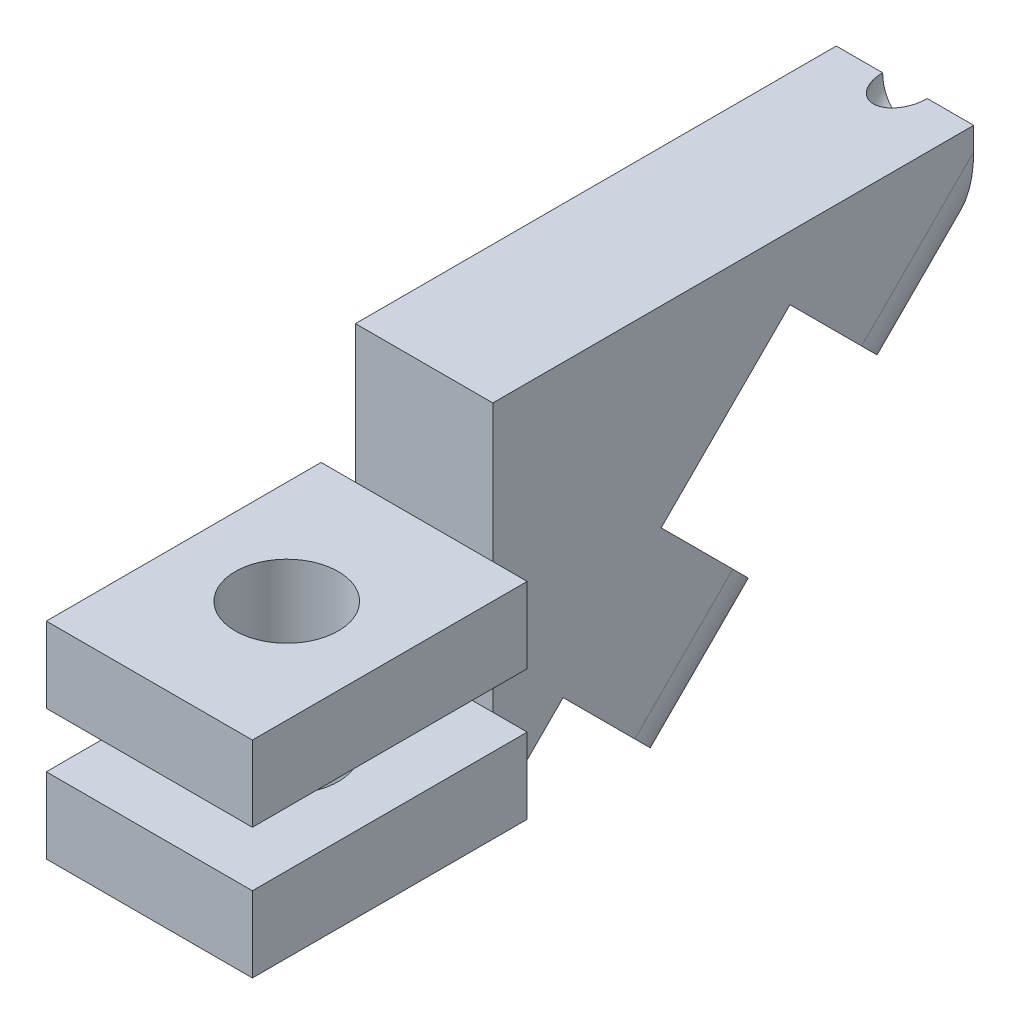
ISO-10303-21;
HEADER;
FILE_DESCRIPTION(('STEP AP214'),'2;1');
FILE_NAME('part.step','',(''),(''),'','','');
FILE_SCHEMA(('AUTOMOTIVE_DESIGN { 1 0 10303 214 1 1 1 1 }'));
ENDSEC;
DATA;
#1=APPLICATION_CONTEXT('core data for automotive mechanical design processes');
#2=APPLICATION_PROTOCOL_DEFINITION('international standard','automotive_design',2000,#1);
#3=PRODUCT_CONTEXT('',#1,'mechanical');
#4=PRODUCT('Part','Part','',(#3));
#5=PRODUCT_RELATED_PRODUCT_CATEGORY('part','',(#4));
#6=PRODUCT_DEFINITION_FORMATION('','',#4);
#7=PRODUCT_DEFINITION_CONTEXT('part definition',#1,'design');
#8=PRODUCT_DEFINITION('design','',#6,#7);
#9=PRODUCT_DEFINITION_SHAPE('','',#8);
#10=(LENGTH_UNIT() NAMED_UNIT(*) SI_UNIT(.MILLI.,.METRE.));
#11=(NAMED_UNIT(*) PLANE_ANGLE_UNIT() SI_UNIT($,.RADIAN.));
#12=(NAMED_UNIT(*) SI_UNIT($,.STERADIAN.) SOLID_ANGLE_UNIT());
#13=UNCERTAINTY_MEASURE_WITH_UNIT(LENGTH_MEASURE(1.E-05),#10,'distance_accuracy_value','');
#14=(GEOMETRIC_REPRESENTATION_CONTEXT(3) GLOBAL_UNCERTAINTY_ASSIGNED_CONTEXT((#13)) GLOBAL_UNIT_ASSIGNED_CONTEXT((#10,
#11,#12)) REPRESENTATION_CONTEXT('',''));
#15=CARTESIAN_POINT('',(0.,0.,0.));
#16=DIRECTION('',(0.,0.,1.));
#17=DIRECTION('',(1.,0.,0.));
#18=AXIS2_PLACEMENT_3D('',#15,#16,#17);
#19=CARTESIAN_POINT('',(0.,17.,2.50000000000004));
#20=DIRECTION('',(0.,-0.707106781186549,0.707106781186546));
#21=DIRECTION('',(0.,-0.707106781186546,-0.707106781186549));
#22=AXIS2_PLACEMENT_3D('',#19,#20,#21);
#23=CYLINDRICAL_SURFACE('',#22,0.65);
#24=CARTESIAN_POINT('',(0.,4.90196487232237,14.5980351276777));
#25=DIRECTION('',(0.,0.707106781186547,-0.707106781186548));
#26=DIRECTION('',(0.,0.707106781186548,0.707106781186547));
#27=AXIS2_PLACEMENT_3D('',#24,#25,#26);
#28=CIRCLE('',#27,0.65);
#29=CARTESIAN_POINT('',(0.,5.36158428009362,15.0576545354489));
#30=VERTEX_POINT('',#29);
#31=EDGE_CURVE('E363',#30,#30,#28,.F.);
#32=ORIENTED_EDGE('',*,*,#31,.T.);
#33=EDGE_LOOP('',(#32));
#34=FACE_BOUND('',#33,.T.);
#35=CARTESIAN_POINT('',(0.,8.5,11.));
#36=DIRECTION('',(0.,-1.,0.));
#37=DIRECTION('',(0.,0.,1.));
#38=AXIS2_PLACEMENT_3D('',#35,#36,#37);
#39=ELLIPSE('',#38,0.91923881554251,0.65);
#40=CARTESIAN_POINT('',(0.650000000000012,8.5,11.));
#41=VERTEX_POINT('',#40);
#42=CARTESIAN_POINT('',(-0.649999999999991,8.5,11.));
#43=VERTEX_POINT('',#42);
#44=EDGE_CURVE('E307',#41,#43,#39,.T.);
#45=ORIENTED_EDGE('',*,*,#44,.F.);
#46=CARTESIAN_POINT('',(0.,8.50000000000003,11.));
#47=DIRECTION('',(0.,0.,1.));
#48=DIRECTION('',(0.,-1.,0.));
#49=AXIS2_PLACEMENT_3D('',#46,#47,#48);
#50=ELLIPSE('',#49,0.919238815542513,0.65);
#51=EDGE_CURVE('E322',#43,#41,#50,.T.);
#52=ORIENTED_EDGE('',*,*,#51,.F.);
#53=EDGE_LOOP('',(#45,#52));
#54=FACE_BOUND('',#53,.T.);
#55=ADVANCED_FACE('F34',(#34,#54),#23,.F.);
#56=CARTESIAN_POINT('',(3.,-1.5,25.));
#57=DIRECTION('',(0.,0.,-1.));
#58=DIRECTION('',(-1.,0.,0.));
#59=AXIS2_PLACEMENT_3D('',#56,#57,#58);
#60=PLANE('',#59);
#61=DIRECTION('',(0.,1.,0.));
#62=VECTOR('',#61,1.);
#63=CARTESIAN_POINT('',(-3.,-1.5,25.));
#64=LINE('',#63,#62);
#65=CARTESIAN_POINT('',(-3.,-1.5,25.));
#66=VERTEX_POINT('',#65);
#67=CARTESIAN_POINT('',(-3.,0.7,25.));
#68=VERTEX_POINT('',#67);
#69=EDGE_CURVE('E304',#66,#68,#64,.T.);
#70=ORIENTED_EDGE('',*,*,#69,.T.);
#71=DIRECTION('',(-1.,0.,0.));
#72=VECTOR('',#71,1.);
#73=CARTESIAN_POINT('',(-3.,0.7,25.));
#74=LINE('',#73,#72);
#75=CARTESIAN_POINT('',(-2.,0.7,25.));
#76=VERTEX_POINT('',#75);
#77=EDGE_CURVE('E243',#76,#68,#74,.T.);
#78=ORIENTED_EDGE('',*,*,#77,.F.);
#79=DIRECTION('',(0.,1.,0.));
#80=VECTOR('',#79,1.);
#81=CARTESIAN_POINT('',(-2.,8.5,25.));
#82=LINE('',#81,#80);
#83=CARTESIAN_POINT('',(-2.,-1.5,25.));
#84=VERTEX_POINT('',#83);
#85=EDGE_CURVE('E334',#84,#76,#82,.T.);
#86=ORIENTED_EDGE('',*,*,#85,.F.);
#87=DIRECTION('',(-1.,0.,0.));
#88=VECTOR('',#87,1.);
#89=CARTESIAN_POINT('',(3.,-1.5,25.));
#90=LINE('',#89,#88);
#91=EDGE_CURVE('E298',#84,#66,#90,.T.);
#92=ORIENTED_EDGE('',*,*,#91,.T.);
#93=EDGE_LOOP('',(#70,#78,#86,#92));
#94=FACE_BOUND('',#93,.T.);
#95=ADVANCED_FACE('F475',(#94),#60,.T.);
#96=DIRECTION('',(0.,-1.,0.));
#97=VECTOR('',#96,1.);
#98=CARTESIAN_POINT('',(2.,8.5,25.));
#99=LINE('',#98,#97);
#100=CARTESIAN_POINT('',(2.,0.7,25.));
#101=VERTEX_POINT('',#100);
#102=CARTESIAN_POINT('',(2.,-1.5,25.));
#103=VERTEX_POINT('',#102);
#104=EDGE_CURVE('E342',#101,#103,#99,.T.);
#105=ORIENTED_EDGE('',*,*,#104,.F.);
#106=CARTESIAN_POINT('',(3.,0.7,25.));
#107=VERTEX_POINT('',#106);
#108=EDGE_CURVE('E244',#107,#101,#74,.T.);
#109=ORIENTED_EDGE('',*,*,#108,.F.);
#110=DIRECTION('',(0.,1.,0.));
#111=VECTOR('',#110,1.);
#112=CARTESIAN_POINT('',(3.,-1.5,25.));
#113=LINE('',#112,#111);
#114=CARTESIAN_POINT('',(3.,-1.5,25.));
#115=VERTEX_POINT('',#114);
#116=EDGE_CURVE('E309',#115,#107,#113,.T.);
#117=ORIENTED_EDGE('',*,*,#116,.F.);
#118=EDGE_CURVE('E299',#115,#103,#90,.T.);
#119=ORIENTED_EDGE('',*,*,#118,.T.);
#120=EDGE_LOOP('',(#105,#109,#117,#119));
#121=FACE_BOUND('',#120,.T.);
#122=ADVANCED_FACE('F493',(#121),#60,.T.);
#123=CARTESIAN_POINT('',(-3.,-1.5,33.));
#124=DIRECTION('',(-1.,0.,0.));
#125=DIRECTION('',(0.,0.,1.));
#126=AXIS2_PLACEMENT_3D('',#123,#124,#125);
#127=PLANE('',#126);
#128=DIRECTION('',(0.,1.,0.));
#129=VECTOR('',#128,1.);
#130=CARTESIAN_POINT('',(-3.,-1.5,33.));
#131=LINE('',#130,#129);
#132=CARTESIAN_POINT('',(-3.,-1.5,33.));
#133=VERTEX_POINT('',#132);
#134=CARTESIAN_POINT('',(-3.,0.7,33.));
#135=VERTEX_POINT('',#134);
#136=EDGE_CURVE('E317',#133,#135,#131,.T.);
#137=ORIENTED_EDGE('',*,*,#136,.T.);
#138=DIRECTION('',(0.,0.,1.));
#139=VECTOR('',#138,1.);
#140=CARTESIAN_POINT('',(-3.,0.7,25.));
#141=LINE('',#140,#139);
#142=EDGE_CURVE('E230',#68,#135,#141,.T.);
#143=ORIENTED_EDGE('',*,*,#142,.F.);
#144=ORIENTED_EDGE('',*,*,#69,.F.);
#145=DIRECTION('',(0.,0.,1.));
#146=VECTOR('',#145,1.);
#147=CARTESIAN_POINT('',(-3.,-1.5,33.));
#148=LINE('',#147,#146);
#149=EDGE_CURVE('E288',#66,#133,#148,.T.);
#150=ORIENTED_EDGE('',*,*,#149,.T.);
#151=EDGE_LOOP('',(#137,#143,#144,#150));
#152=FACE_BOUND('',#151,.T.);
#153=ADVANCED_FACE('F480',(#152),#127,.T.);
#154=CARTESIAN_POINT('',(3.,-1.5,33.));
#155=DIRECTION('',(1.,0.,0.));
#156=DIRECTION('',(0.,0.,-1.));
#157=AXIS2_PLACEMENT_3D('',#154,#155,#156);
#158=PLANE('',#157);
#159=ORIENTED_EDGE('',*,*,#116,.T.);
#160=DIRECTION('',(0.,0.,-1.));
#161=VECTOR('',#160,1.);
#162=CARTESIAN_POINT('',(3.,0.7,33.));
#163=LINE('',#162,#161);
#164=CARTESIAN_POINT('',(3.,0.7,33.));
#165=VERTEX_POINT('',#164);
#166=EDGE_CURVE('E241',#165,#107,#163,.T.);
#167=ORIENTED_EDGE('',*,*,#166,.F.);
#168=DIRECTION('',(0.,1.,0.));
#169=VECTOR('',#168,1.);
#170=CARTESIAN_POINT('',(3.,-1.5,33.));
#171=LINE('',#170,#169);
#172=CARTESIAN_POINT('',(3.,-1.5,33.));
#173=VERTEX_POINT('',#172);
#174=EDGE_CURVE('E313',#173,#165,#171,.T.);
#175=ORIENTED_EDGE('',*,*,#174,.F.);
#176=DIRECTION('',(0.,0.,-1.));
#177=VECTOR('',#176,1.);
#178=CARTESIAN_POINT('',(3.,-1.5,33.));
#179=LINE('',#178,#177);
#180=EDGE_CURVE('E295',#173,#115,#179,.T.);
#181=ORIENTED_EDGE('',*,*,#180,.T.);
#182=EDGE_LOOP('',(#159,#167,#175,#181));
#183=FACE_BOUND('',#182,.T.);
#184=ADVANCED_FACE('F491',(#183),#158,.T.);
#185=CARTESIAN_POINT('',(3.,-1.5,33.));
#186=DIRECTION('',(0.,0.,1.));
#187=DIRECTION('',(1.,0.,0.));
#188=AXIS2_PLACEMENT_3D('',#185,#186,#187);
#189=PLANE('',#188);
#190=ORIENTED_EDGE('',*,*,#174,.T.);
#191=DIRECTION('',(1.,0.,0.));
#192=VECTOR('',#191,1.);
#193=CARTESIAN_POINT('',(-3.,0.7,33.));
#194=LINE('',#193,#192);
#195=EDGE_CURVE('E233',#135,#165,#194,.T.);
#196=ORIENTED_EDGE('',*,*,#195,.F.);
#197=ORIENTED_EDGE('',*,*,#136,.F.);
#198=DIRECTION('',(1.,0.,0.));
#199=VECTOR('',#198,1.);
#200=CARTESIAN_POINT('',(3.,-1.5,33.));
#201=LINE('',#200,#199);
#202=EDGE_CURVE('E292',#133,#173,#201,.T.);
#203=ORIENTED_EDGE('',*,*,#202,.T.);
#204=EDGE_LOOP('',(#190,#196,#197,#203));
#205=FACE_BOUND('',#204,.T.);
#206=ADVANCED_FACE('F487',(#205),#189,.T.);
#207=CARTESIAN_POINT('',(0.,-5.5,29.));
#208=DIRECTION('',(0.,1.,0.));
#209=DIRECTION('',(0.,0.,1.));
#210=AXIS2_PLACEMENT_3D('',#207,#208,#209);
#211=CYLINDRICAL_SURFACE('',#210,1.5);
#212=CARTESIAN_POINT('',(0.,-1.5,29.));
#213=DIRECTION('',(0.,1.,0.));
#214=DIRECTION('',(0.,0.,1.));
#215=AXIS2_PLACEMENT_3D('',#212,#213,#214);
#216=CIRCLE('',#215,1.5);
#217=CARTESIAN_POINT('',(0.,-1.5,30.5));
#218=VERTEX_POINT('',#217);
#219=EDGE_CURVE('E272',#218,#218,#216,.T.);
#220=ORIENTED_EDGE('',*,*,#219,.F.);
#221=EDGE_LOOP('',(#220));
#222=FACE_BOUND('',#221,.T.);
#223=CARTESIAN_POINT('',(0.,0.7,29.));
#224=DIRECTION('',(0.,1.,0.));
#225=DIRECTION('',(0.,0.,1.));
#226=AXIS2_PLACEMENT_3D('',#223,#224,#225);
#227=CIRCLE('',#226,1.5);
#228=CARTESIAN_POINT('',(0.,0.7,30.5));
#229=VERTEX_POINT('',#228);
#230=EDGE_CURVE('E261',#229,#229,#227,.F.);
#231=ORIENTED_EDGE('',*,*,#230,.F.);
#232=EDGE_LOOP('',(#231));
#233=FACE_BOUND('',#232,.T.);
#234=ADVANCED_FACE('F550',(#222,#233),#211,.F.);
#235=CARTESIAN_POINT('',(21.7989898732233,8.5,25.));
#236=DIRECTION('',(0.,0.,-1.));
#237=DIRECTION('',(-1.,0.,0.));
#238=AXIS2_PLACEMENT_3D('',#235,#236,#237);
#239=PLANE('',#238);
#240=DIRECTION('',(-1.,0.,0.));
#241=VECTOR('',#240,1.);
#242=CARTESIAN_POINT('',(3.,4.5,25.));
#243=LINE('',#242,#241);
#244=CARTESIAN_POINT('',(2.,4.5,25.));
#245=VERTEX_POINT('',#244);
#246=CARTESIAN_POINT('',(-2.,4.5,25.));
#247=VERTEX_POINT('',#246);
#248=EDGE_CURVE('E289',#245,#247,#243,.T.);
#249=ORIENTED_EDGE('',*,*,#248,.F.);
#250=CARTESIAN_POINT('',(2.,8.5,25.));
#251=VERTEX_POINT('',#250);
#252=EDGE_CURVE('E338',#251,#245,#99,.T.);
#253=ORIENTED_EDGE('',*,*,#252,.F.);
#254=DIRECTION('',(-1.,0.,0.));
#255=VECTOR('',#254,1.);
#256=CARTESIAN_POINT('',(21.7989898732233,8.5,25.));
#257=LINE('',#256,#255);
#258=CARTESIAN_POINT('',(-2.,8.5,25.));
#259=VERTEX_POINT('',#258);
#260=EDGE_CURVE('E333',#251,#259,#257,.T.);
#261=ORIENTED_EDGE('',*,*,#260,.T.);
#262=EDGE_CURVE('E330',#247,#259,#82,.T.);
#263=ORIENTED_EDGE('',*,*,#262,.F.);
#264=EDGE_LOOP('',(#249,#253,#261,#263));
#265=FACE_BOUND('',#264,.T.);
#266=ADVANCED_FACE('F440',(#265),#239,.F.);
#267=CARTESIAN_POINT('',(-2.,0.,0.));
#268=DIRECTION('',(1.,0.,0.));
#269=DIRECTION('',(0.,0.,-1.));
#270=AXIS2_PLACEMENT_3D('',#267,#268,#269);
#271=PLANE('',#270);
#272=DIRECTION('',(0.,-1.,0.));
#273=VECTOR('',#272,1.);
#274=CARTESIAN_POINT('',(-2.,8.5,11.));
#275=LINE('',#274,#273);
#276=CARTESIAN_POINT('',(-2.,8.5,11.));
#277=VERTEX_POINT('',#276);
#278=CARTESIAN_POINT('',(-2.,7.82842712474622,11.));
#279=VERTEX_POINT('',#278);
#280=EDGE_CURVE('E325',#277,#279,#275,.T.);
#281=ORIENTED_EDGE('',*,*,#280,.T.);
#282=DIRECTION('',(0.,-0.707106781186555,0.70710678118654));
#283=VECTOR('',#282,1.);
#284=CARTESIAN_POINT('',(-2.,9.41421356237302,9.41421356237323));
#285=LINE('',#284,#283);
#286=CARTESIAN_POINT('',(-2.,4.56617843469543,14.2622486900507));
#287=VERTEX_POINT('',#286);
#288=EDGE_CURVE('E374',#279,#287,#285,.T.);
#289=ORIENTED_EDGE('',*,*,#288,.T.);
#290=DIRECTION('',(0.,0.707106781186548,0.707106781186547));
#291=VECTOR('',#290,1.);
#292=CARTESIAN_POINT('',(-2.,-4.84803512767764,4.84803512767764));
#293=LINE('',#292,#291);
#294=CARTESIAN_POINT('',(-2.,6.65196487232237,16.3480351276777));
#295=VERTEX_POINT('',#294);
#296=EDGE_CURVE('E229',#287,#295,#293,.T.);
#297=ORIENTED_EDGE('',*,*,#296,.T.);
#298=DIRECTION('',(0.,-0.707106781186547,0.707106781186548));
#299=VECTOR('',#298,1.);
#300=CARTESIAN_POINT('',(-2.,11.5,11.5));
#301=LINE('',#300,#299);
#302=CARTESIAN_POINT('',(-2.,2.90135992503709,20.0986400749629));
#303=VERTEX_POINT('',#302);
#304=EDGE_CURVE('E218',#295,#303,#301,.T.);
#305=ORIENTED_EDGE('',*,*,#304,.T.);
#306=DIRECTION('',(0.,-0.707106781186547,-0.707106781186548));
#307=VECTOR('',#306,1.);
#308=CARTESIAN_POINT('',(-2.,-8.59864007496292,8.59864007496291));
#309=LINE('',#308,#307);
#310=CARTESIAN_POINT('',(-2.,0.815573487410156,18.012853637336));
#311=VERTEX_POINT('',#310);
#312=EDGE_CURVE('E201',#303,#311,#309,.T.);
#313=ORIENTED_EDGE('',*,*,#312,.T.);
#314=DIRECTION('',(0.,-0.707106781186546,0.707106781186549));
#315=VECTOR('',#314,1.);
#316=CARTESIAN_POINT('',(-2.,9.41421356237307,9.41421356237304));
#317=LINE('',#316,#315);
#318=CARTESIAN_POINT('',(-2.,-2.03866361747591,20.8670907422221));
#319=VERTEX_POINT('',#318);
#320=EDGE_CURVE('E372',#311,#319,#317,.T.);
#321=ORIENTED_EDGE('',*,*,#320,.T.);
#322=DIRECTION('',(0.,0.707106781186547,0.707106781186548));
#323=VECTOR('',#322,1.);
#324=CARTESIAN_POINT('',(-2.,-11.452877179849,11.452877179849));
#325=LINE('',#324,#323);
#326=CARTESIAN_POINT('',(-2.,0.0471228201510115,22.952877179849));
#327=VERTEX_POINT('',#326);
#328=EDGE_CURVE('E367',#319,#327,#325,.T.);
#329=ORIENTED_EDGE('',*,*,#328,.T.);
#330=DIRECTION('',(0.,-0.707106781186549,0.707106781186546));
#331=VECTOR('',#330,1.);
#332=CARTESIAN_POINT('',(-2.,11.5,11.5000000000001));
#333=LINE('',#332,#331);
#334=CARTESIAN_POINT('',(-2.,-1.99999999999999,25.));
#335=VERTEX_POINT('',#334);
#336=EDGE_CURVE('E231',#327,#335,#333,.T.);
#337=ORIENTED_EDGE('',*,*,#336,.T.);
#338=EDGE_CURVE('E331',#335,#84,#82,.T.);
#339=ORIENTED_EDGE('',*,*,#338,.T.);
#340=ORIENTED_EDGE('',*,*,#85,.T.);
#341=DIRECTION('',(0.,-1.,0.));
#342=VECTOR('',#341,1.);
#343=CARTESIAN_POINT('',(-2.,0.,25.));
#344=LINE('',#343,#342);
#345=CARTESIAN_POINT('',(-2.,2.3,25.));
#346=VERTEX_POINT('',#345);
#347=EDGE_CURVE('E266',#346,#76,#344,.T.);
#348=ORIENTED_EDGE('',*,*,#347,.F.);
#349=EDGE_CURVE('E335',#346,#247,#82,.T.);
#350=ORIENTED_EDGE('',*,*,#349,.T.);
#351=ORIENTED_EDGE('',*,*,#262,.T.);
#352=DIRECTION('',(0.,0.,-1.));
#353=VECTOR('',#352,1.);
#354=CARTESIAN_POINT('',(-2.,8.5,25.));
#355=LINE('',#354,#353);
#356=EDGE_CURVE('E327',#259,#277,#355,.T.);
#357=ORIENTED_EDGE('',*,*,#356,.T.);
#358=EDGE_LOOP('',(#281,#289,#297,#305,#313,#321,#329,#337,#339,#340,#348,#350,#351,#357));
#359=FACE_BOUND('',#358,.T.);
#360=ADVANCED_FACE('F226',(#359),#271,.F.);
#361=CARTESIAN_POINT('',(2.,0.,0.));
#362=DIRECTION('',(1.,0.,0.));
#363=DIRECTION('',(0.,0.,-1.));
#364=AXIS2_PLACEMENT_3D('',#361,#362,#363);
#365=PLANE('',#364);
#366=DIRECTION('',(0.,0.707106781186548,0.707106781186547));
#367=VECTOR('',#366,1.);
#368=CARTESIAN_POINT('',(2.,-4.84803512767764,4.84803512767764));
#369=LINE('',#368,#367);
#370=CARTESIAN_POINT('',(2.,4.56617843469543,14.2622486900507));
#371=VERTEX_POINT('',#370);
#372=CARTESIAN_POINT('',(2.,6.65196487232237,16.3480351276777));
#373=VERTEX_POINT('',#372);
#374=EDGE_CURVE('E366',#371,#373,#369,.T.);
#375=ORIENTED_EDGE('',*,*,#374,.F.);
#376=DIRECTION('',(0.,-0.707106781186555,0.70710678118654));
#377=VECTOR('',#376,1.);
#378=CARTESIAN_POINT('',(2.,6.41421356237308,12.4142135623731));
#379=LINE('',#378,#377);
#380=CARTESIAN_POINT('',(2.,7.82842712474622,11.));
#381=VERTEX_POINT('',#380);
#382=EDGE_CURVE('E386',#371,#381,#379,.F.);
#383=ORIENTED_EDGE('',*,*,#382,.T.);
#384=DIRECTION('',(0.,1.,0.));
#385=VECTOR('',#384,1.);
#386=CARTESIAN_POINT('',(2.,8.5,11.));
#387=LINE('',#386,#385);
#388=CARTESIAN_POINT('',(2.00000000000001,8.5,11.));
#389=VERTEX_POINT('',#388);
#390=EDGE_CURVE('E336',#381,#389,#387,.T.);
#391=ORIENTED_EDGE('',*,*,#390,.T.);
#392=DIRECTION('',(0.,0.,1.));
#393=VECTOR('',#392,1.);
#394=CARTESIAN_POINT('',(2.,8.5,25.));
#395=LINE('',#394,#393);
#396=EDGE_CURVE('E343',#389,#251,#395,.T.);
#397=ORIENTED_EDGE('',*,*,#396,.T.);
#398=ORIENTED_EDGE('',*,*,#252,.T.);
#399=CARTESIAN_POINT('',(2.,2.3,25.));
#400=VERTEX_POINT('',#399);
#401=EDGE_CURVE('E341',#245,#400,#99,.T.);
#402=ORIENTED_EDGE('',*,*,#401,.T.);
#403=DIRECTION('',(0.,-1.,0.));
#404=VECTOR('',#403,1.);
#405=CARTESIAN_POINT('',(2.,0.,25.));
#406=LINE('',#405,#404);
#407=EDGE_CURVE('E263',#400,#101,#406,.T.);
#408=ORIENTED_EDGE('',*,*,#407,.T.);
#409=ORIENTED_EDGE('',*,*,#104,.T.);
#410=CARTESIAN_POINT('',(2.,-1.99999999999999,25.));
#411=VERTEX_POINT('',#410);
#412=EDGE_CURVE('E346',#103,#411,#99,.T.);
#413=ORIENTED_EDGE('',*,*,#412,.T.);
#414=DIRECTION('',(0.,-0.707106781186549,0.707106781186546));
#415=VECTOR('',#414,1.);
#416=CARTESIAN_POINT('',(2.,11.5,11.5000000000001));
#417=LINE('',#416,#415);
#418=CARTESIAN_POINT('',(2.,0.0471228201510115,22.952877179849));
#419=VERTEX_POINT('',#418);
#420=EDGE_CURVE('E236',#419,#411,#417,.T.);
#421=ORIENTED_EDGE('',*,*,#420,.F.);
#422=DIRECTION('',(0.,0.707106781186547,0.707106781186548));
#423=VECTOR('',#422,1.);
#424=CARTESIAN_POINT('',(2.,-11.452877179849,11.452877179849));
#425=LINE('',#424,#423);
#426=CARTESIAN_POINT('',(2.,-2.03866361747591,20.8670907422221));
#427=VERTEX_POINT('',#426);
#428=EDGE_CURVE('E362',#427,#419,#425,.T.);
#429=ORIENTED_EDGE('',*,*,#428,.F.);
#430=DIRECTION('',(0.,-0.707106781186546,0.707106781186549));
#431=VECTOR('',#430,1.);
#432=CARTESIAN_POINT('',(2.,0.815573487410158,18.012853637336));
#433=LINE('',#432,#431);
#434=CARTESIAN_POINT('',(2.,0.815573487410156,18.012853637336));
#435=VERTEX_POINT('',#434);
#436=EDGE_CURVE('E384',#427,#435,#433,.F.);
#437=ORIENTED_EDGE('',*,*,#436,.T.);
#438=DIRECTION('',(0.,-0.707106781186547,-0.707106781186548));
#439=VECTOR('',#438,1.);
#440=CARTESIAN_POINT('',(2.,-8.59864007496292,8.59864007496291));
#441=LINE('',#440,#439);
#442=CARTESIAN_POINT('',(2.,2.90135992503709,20.0986400749629));
#443=VERTEX_POINT('',#442);
#444=EDGE_CURVE('E212',#443,#435,#441,.T.);
#445=ORIENTED_EDGE('',*,*,#444,.F.);
#446=DIRECTION('',(0.,-0.707106781186547,0.707106781186548));
#447=VECTOR('',#446,1.);
#448=CARTESIAN_POINT('',(2.,11.5,11.5));
#449=LINE('',#448,#447);
#450=EDGE_CURVE('E221',#373,#443,#449,.T.);
#451=ORIENTED_EDGE('',*,*,#450,.F.);
#452=EDGE_LOOP('',(#375,#383,#391,#397,#398,#402,#408,#409,#413,#421,#429,#437,#445,#451));
#453=FACE_BOUND('',#452,.T.);
#454=ADVANCED_FACE('F409',(#453),#365,.T.);
#455=ORIENTED_EDGE('',*,*,#338,.F.);
#456=DIRECTION('',(1.,0.,0.));
#457=VECTOR('',#456,1.);
#458=CARTESIAN_POINT('',(21.7989898732233,-1.99999999999999,25.));
#459=LINE('',#458,#457);
#460=EDGE_CURVE('E368',#335,#411,#459,.T.);
#461=ORIENTED_EDGE('',*,*,#460,.T.);
#462=ORIENTED_EDGE('',*,*,#412,.F.);
#463=EDGE_CURVE('E303',#103,#84,#90,.T.);
#464=ORIENTED_EDGE('',*,*,#463,.T.);
#465=EDGE_LOOP('',(#455,#461,#462,#464));
#466=FACE_BOUND('',#465,.T.);
#467=ADVANCED_FACE('F422',(#466),#239,.F.);
#468=CARTESIAN_POINT('',(21.7989898732233,8.5,11.));
#469=DIRECTION('',(0.,0.,1.));
#470=DIRECTION('',(1.,0.,0.));
#471=AXIS2_PLACEMENT_3D('',#468,#469,#470);
#472=PLANE('',#471);
#473=CARTESIAN_POINT('',(0.,7.82842712474622,11.));
#474=DIRECTION('',(0.,0.,1.));
#475=DIRECTION('',(0.,1.,0.));
#476=AXIS2_PLACEMENT_3D('',#473,#474,#475);
#477=ELLIPSE('',#476,2.82842712474622,2.);
#478=CARTESIAN_POINT('',(0.,5.,11.));
#479=VERTEX_POINT('',#478);
#480=EDGE_CURVE('E380',#381,#479,#477,.F.);
#481=ORIENTED_EDGE('',*,*,#480,.T.);
#482=CARTESIAN_POINT('',(0.,7.82842712474622,11.));
#483=DIRECTION('',(0.,0.,1.));
#484=DIRECTION('',(0.,-1.,0.));
#485=AXIS2_PLACEMENT_3D('',#482,#483,#484);
#486=ELLIPSE('',#485,2.82842712474622,2.);
#487=EDGE_CURVE('E382',#479,#279,#486,.F.);
#488=ORIENTED_EDGE('',*,*,#487,.T.);
#489=ORIENTED_EDGE('',*,*,#280,.F.);
#490=DIRECTION('',(-1.,0.,0.));
#491=VECTOR('',#490,1.);
#492=CARTESIAN_POINT('',(21.7989898732233,8.5,11.));
#493=LINE('',#492,#491);
#494=EDGE_CURVE('E350',#43,#277,#493,.T.);
#495=ORIENTED_EDGE('',*,*,#494,.F.);
#496=ORIENTED_EDGE('',*,*,#51,.T.);
#497=EDGE_CURVE('E347',#389,#41,#493,.T.);
#498=ORIENTED_EDGE('',*,*,#497,.F.);
#499=ORIENTED_EDGE('',*,*,#390,.F.);
#500=EDGE_LOOP('',(#481,#488,#489,#495,#496,#498,#499));
#501=FACE_BOUND('',#500,.T.);
#502=ADVANCED_FACE('F624',(#501),#472,.F.);
#503=CARTESIAN_POINT('',(21.7989898732233,8.5,25.));
#504=DIRECTION('',(0.,-1.,0.));
#505=DIRECTION('',(0.,0.,-1.));
#506=AXIS2_PLACEMENT_3D('',#503,#504,#505);
#507=PLANE('',#506);
#508=ORIENTED_EDGE('',*,*,#497,.T.);
#509=ORIENTED_EDGE('',*,*,#44,.T.);
#510=ORIENTED_EDGE('',*,*,#494,.T.);
#511=ORIENTED_EDGE('',*,*,#356,.F.);
#512=ORIENTED_EDGE('',*,*,#260,.F.);
#513=ORIENTED_EDGE('',*,*,#396,.F.);
#514=EDGE_LOOP('',(#508,#509,#510,#511,#512,#513));
#515=FACE_BOUND('',#514,.T.);
#516=ADVANCED_FACE('F669',(#515),#507,.F.);
#517=DIRECTION('',(-1.,0.,0.));
#518=VECTOR('',#517,1.);
#519=CARTESIAN_POINT('',(-3.,2.3,25.));
#520=LINE('',#519,#518);
#521=CARTESIAN_POINT('',(-3.,2.3,25.));
#522=VERTEX_POINT('',#521);
#523=EDGE_CURVE('E257',#346,#522,#520,.T.);
#524=ORIENTED_EDGE('',*,*,#523,.T.);
#525=CARTESIAN_POINT('',(-3.,4.5,25.));
#526=VERTEX_POINT('',#525);
#527=EDGE_CURVE('E308',#522,#526,#64,.T.);
#528=ORIENTED_EDGE('',*,*,#527,.T.);
#529=EDGE_CURVE('E284',#247,#526,#243,.T.);
#530=ORIENTED_EDGE('',*,*,#529,.F.);
#531=ORIENTED_EDGE('',*,*,#349,.F.);
#532=EDGE_LOOP('',(#524,#528,#530,#531));
#533=FACE_BOUND('',#532,.T.);
#534=ADVANCED_FACE('F462',(#533),#60,.T.);
#535=CARTESIAN_POINT('',(3.,2.3,25.));
#536=VERTEX_POINT('',#535);
#537=EDGE_CURVE('E258',#536,#400,#520,.T.);
#538=ORIENTED_EDGE('',*,*,#537,.T.);
#539=ORIENTED_EDGE('',*,*,#401,.F.);
#540=CARTESIAN_POINT('',(3.,4.5,25.));
#541=VERTEX_POINT('',#540);
#542=EDGE_CURVE('E285',#541,#245,#243,.T.);
#543=ORIENTED_EDGE('',*,*,#542,.F.);
#544=EDGE_CURVE('E312',#536,#541,#113,.T.);
#545=ORIENTED_EDGE('',*,*,#544,.F.);
#546=EDGE_LOOP('',(#538,#539,#543,#545));
#547=FACE_BOUND('',#546,.T.);
#548=ADVANCED_FACE('F430',(#547),#60,.T.);
#549=DIRECTION('',(0.,0.,1.));
#550=VECTOR('',#549,1.);
#551=CARTESIAN_POINT('',(-3.,2.3,25.));
#552=LINE('',#551,#550);
#553=CARTESIAN_POINT('',(-3.,2.3,33.));
#554=VERTEX_POINT('',#553);
#555=EDGE_CURVE('E247',#522,#554,#552,.T.);
#556=ORIENTED_EDGE('',*,*,#555,.T.);
#557=CARTESIAN_POINT('',(-3.,4.5,33.));
#558=VERTEX_POINT('',#557);
#559=EDGE_CURVE('E302',#554,#558,#131,.T.);
#560=ORIENTED_EDGE('',*,*,#559,.T.);
#561=DIRECTION('',(0.,0.,1.));
#562=VECTOR('',#561,1.);
#563=CARTESIAN_POINT('',(-3.,4.5,33.));
#564=LINE('',#563,#562);
#565=EDGE_CURVE('E275',#526,#558,#564,.T.);
#566=ORIENTED_EDGE('',*,*,#565,.F.);
#567=ORIENTED_EDGE('',*,*,#527,.F.);
#568=EDGE_LOOP('',(#556,#560,#566,#567));
#569=FACE_BOUND('',#568,.T.);
#570=ADVANCED_FACE('F447',(#569),#127,.T.);
#571=DIRECTION('',(0.,0.,-1.));
#572=VECTOR('',#571,1.);
#573=CARTESIAN_POINT('',(3.,2.3,33.));
#574=LINE('',#573,#572);
#575=CARTESIAN_POINT('',(3.,2.3,33.));
#576=VERTEX_POINT('',#575);
#577=EDGE_CURVE('E254',#576,#536,#574,.T.);
#578=ORIENTED_EDGE('',*,*,#577,.T.);
#579=ORIENTED_EDGE('',*,*,#544,.T.);
#580=DIRECTION('',(0.,0.,-1.));
#581=VECTOR('',#580,1.);
#582=CARTESIAN_POINT('',(3.,4.5,33.));
#583=LINE('',#582,#581);
#584=CARTESIAN_POINT('',(3.,4.5,33.));
#585=VERTEX_POINT('',#584);
#586=EDGE_CURVE('E281',#585,#541,#583,.T.);
#587=ORIENTED_EDGE('',*,*,#586,.F.);
#588=EDGE_CURVE('E316',#576,#585,#171,.T.);
#589=ORIENTED_EDGE('',*,*,#588,.F.);
#590=EDGE_LOOP('',(#578,#579,#587,#589));
#591=FACE_BOUND('',#590,.T.);
#592=ADVANCED_FACE('F454',(#591),#158,.T.);
#593=DIRECTION('',(1.,0.,0.));
#594=VECTOR('',#593,1.);
#595=CARTESIAN_POINT('',(-3.,2.3,33.));
#596=LINE('',#595,#594);
#597=EDGE_CURVE('E251',#554,#576,#596,.T.);
#598=ORIENTED_EDGE('',*,*,#597,.T.);
#599=ORIENTED_EDGE('',*,*,#588,.T.);
#600=DIRECTION('',(1.,0.,0.));
#601=VECTOR('',#600,1.);
#602=CARTESIAN_POINT('',(3.,4.5,33.));
#603=LINE('',#602,#601);
#604=EDGE_CURVE('E278',#558,#585,#603,.T.);
#605=ORIENTED_EDGE('',*,*,#604,.F.);
#606=ORIENTED_EDGE('',*,*,#559,.F.);
#607=EDGE_LOOP('',(#598,#599,#605,#606));
#608=FACE_BOUND('',#607,.T.);
#609=ADVANCED_FACE('F451',(#608),#189,.T.);
#610=CARTESIAN_POINT('',(0.,-1.5,0.));
#611=DIRECTION('',(0.,1.,0.));
#612=DIRECTION('',(0.,0.,1.));
#613=AXIS2_PLACEMENT_3D('',#610,#611,#612);
#614=PLANE('',#613);
#615=ORIENTED_EDGE('',*,*,#219,.T.);
#616=EDGE_LOOP('',(#615));
#617=FACE_BOUND('',#616,.T.);
#618=ORIENTED_EDGE('',*,*,#149,.F.);
#619=ORIENTED_EDGE('',*,*,#91,.F.);
#620=ORIENTED_EDGE('',*,*,#463,.F.);
#621=ORIENTED_EDGE('',*,*,#118,.F.);
#622=ORIENTED_EDGE('',*,*,#180,.F.);
#623=ORIENTED_EDGE('',*,*,#202,.F.);
#624=EDGE_LOOP('',(#618,#619,#620,#621,#622,#623));
#625=FACE_BOUND('',#624,.T.);
#626=ADVANCED_FACE('F483',(#617,#625),#614,.F.);
#627=CARTESIAN_POINT('',(0.,4.5,0.));
#628=DIRECTION('',(0.,1.,0.));
#629=DIRECTION('',(0.,0.,1.));
#630=AXIS2_PLACEMENT_3D('',#627,#628,#629);
#631=PLANE('',#630);
#632=CARTESIAN_POINT('',(0.,4.5,29.));
#633=DIRECTION('',(0.,1.,0.));
#634=DIRECTION('',(0.,0.,1.));
#635=AXIS2_PLACEMENT_3D('',#632,#633,#634);
#636=CIRCLE('',#635,1.5);
#637=CARTESIAN_POINT('',(0.,4.5,30.5));
#638=VERTEX_POINT('',#637);
#639=EDGE_CURVE('E269',#638,#638,#636,.T.);
#640=ORIENTED_EDGE('',*,*,#639,.F.);
#641=EDGE_LOOP('',(#640));
#642=FACE_BOUND('',#641,.T.);
#643=ORIENTED_EDGE('',*,*,#565,.T.);
#644=ORIENTED_EDGE('',*,*,#604,.T.);
#645=ORIENTED_EDGE('',*,*,#586,.T.);
#646=ORIENTED_EDGE('',*,*,#542,.T.);
#647=ORIENTED_EDGE('',*,*,#248,.T.);
#648=ORIENTED_EDGE('',*,*,#529,.T.);
#649=EDGE_LOOP('',(#643,#644,#645,#646,#647,#648));
#650=FACE_BOUND('',#649,.T.);
#651=ADVANCED_FACE('F435',(#642,#650),#631,.T.);
#652=CARTESIAN_POINT('',(0.,2.3,29.));
#653=DIRECTION('',(0.,1.,0.));
#654=DIRECTION('',(0.,0.,1.));
#655=AXIS2_PLACEMENT_3D('',#652,#653,#654);
#656=CIRCLE('',#655,1.5);
#657=CARTESIAN_POINT('',(0.,2.3,30.5));
#658=VERTEX_POINT('',#657);
#659=EDGE_CURVE('E267',#658,#658,#656,.F.);
#660=ORIENTED_EDGE('',*,*,#659,.T.);
#661=EDGE_LOOP('',(#660));
#662=FACE_BOUND('',#661,.T.);
#663=ORIENTED_EDGE('',*,*,#639,.T.);
#664=EDGE_LOOP('',(#663));
#665=FACE_BOUND('',#664,.T.);
#666=ADVANCED_FACE('F546',(#662,#665),#211,.F.);
#667=CARTESIAN_POINT('',(-3.,2.3,25.));
#668=DIRECTION('',(0.,0.,1.));
#669=DIRECTION('',(1.,0.,0.));
#670=AXIS2_PLACEMENT_3D('',#667,#668,#669);
#671=PLANE('',#670);
#672=ORIENTED_EDGE('',*,*,#347,.T.);
#673=EDGE_CURVE('E248',#101,#76,#74,.T.);
#674=ORIENTED_EDGE('',*,*,#673,.F.);
#675=ORIENTED_EDGE('',*,*,#407,.F.);
#676=EDGE_CURVE('E262',#400,#346,#520,.T.);
#677=ORIENTED_EDGE('',*,*,#676,.T.);
#678=EDGE_LOOP('',(#672,#674,#675,#677));
#679=FACE_BOUND('',#678,.T.);
#680=ADVANCED_FACE('F467',(#679),#671,.T.);
#681=CARTESIAN_POINT('',(0.,2.3,0.));
#682=DIRECTION('',(0.,1.,0.));
#683=DIRECTION('',(0.,0.,1.));
#684=AXIS2_PLACEMENT_3D('',#681,#682,#683);
#685=PLANE('',#684);
#686=ORIENTED_EDGE('',*,*,#555,.F.);
#687=ORIENTED_EDGE('',*,*,#523,.F.);
#688=ORIENTED_EDGE('',*,*,#676,.F.);
#689=ORIENTED_EDGE('',*,*,#537,.F.);
#690=ORIENTED_EDGE('',*,*,#577,.F.);
#691=ORIENTED_EDGE('',*,*,#597,.F.);
#692=EDGE_LOOP('',(#686,#687,#688,#689,#690,#691));
#693=FACE_BOUND('',#692,.T.);
#694=ORIENTED_EDGE('',*,*,#659,.F.);
#695=EDGE_LOOP('',(#694));
#696=FACE_BOUND('',#695,.T.);
#697=ADVANCED_FACE('F456',(#693,#696),#685,.F.);
#698=CARTESIAN_POINT('',(0.,0.7,0.));
#699=DIRECTION('',(0.,1.,0.));
#700=DIRECTION('',(0.,0.,1.));
#701=AXIS2_PLACEMENT_3D('',#698,#699,#700);
#702=PLANE('',#701);
#703=ORIENTED_EDGE('',*,*,#142,.T.);
#704=ORIENTED_EDGE('',*,*,#195,.T.);
#705=ORIENTED_EDGE('',*,*,#166,.T.);
#706=ORIENTED_EDGE('',*,*,#108,.T.);
#707=ORIENTED_EDGE('',*,*,#673,.T.);
#708=ORIENTED_EDGE('',*,*,#77,.T.);
#709=EDGE_LOOP('',(#703,#704,#705,#706,#707,#708));
#710=FACE_BOUND('',#709,.T.);
#711=ORIENTED_EDGE('',*,*,#230,.T.);
#712=EDGE_LOOP('',(#711));
#713=FACE_BOUND('',#712,.T.);
#714=ADVANCED_FACE('F470',(#710,#713),#702,.T.);
#715=CARTESIAN_POINT('',(-6.,6.65196487232237,16.3480351276777));
#716=DIRECTION('',(0.,0.707106781186548,0.707106781186547));
#717=DIRECTION('',(0.,-0.707106781186547,0.707106781186548));
#718=AXIS2_PLACEMENT_3D('',#715,#716,#717);
#719=PLANE('',#718);
#720=DIRECTION('',(1.,0.,0.));
#721=VECTOR('',#720,1.);
#722=CARTESIAN_POINT('',(-6.,6.65196487232237,16.3480351276777));
#723=LINE('',#722,#721);
#724=EDGE_CURVE('E223',#295,#373,#723,.T.);
#725=ORIENTED_EDGE('',*,*,#724,.T.);
#726=ORIENTED_EDGE('',*,*,#450,.T.);
#727=DIRECTION('',(1.,0.,0.));
#728=VECTOR('',#727,1.);
#729=CARTESIAN_POINT('',(-6.,2.90135992503709,20.0986400749629));
#730=LINE('',#729,#728);
#731=EDGE_CURVE('E204',#303,#443,#730,.T.);
#732=ORIENTED_EDGE('',*,*,#731,.F.);
#733=ORIENTED_EDGE('',*,*,#304,.F.);
#734=EDGE_LOOP('',(#725,#726,#732,#733));
#735=FACE_BOUND('',#734,.T.);
#736=ADVANCED_FACE('F217',(#735),#719,.F.);
#737=CARTESIAN_POINT('',(-6.,0.0471228201510115,22.952877179849));
#738=DIRECTION('',(0.,0.707106781186546,0.707106781186549));
#739=DIRECTION('',(0.,-0.707106781186549,0.707106781186546));
#740=AXIS2_PLACEMENT_3D('',#737,#738,#739);
#741=PLANE('',#740);
#742=DIRECTION('',(1.,0.,0.));
#743=VECTOR('',#742,1.);
#744=CARTESIAN_POINT('',(-6.,0.0471228201510115,22.952877179849));
#745=LINE('',#744,#743);
#746=EDGE_CURVE('E222',#327,#419,#745,.T.);
#747=ORIENTED_EDGE('',*,*,#746,.T.);
#748=ORIENTED_EDGE('',*,*,#420,.T.);
#749=ORIENTED_EDGE('',*,*,#460,.F.);
#750=ORIENTED_EDGE('',*,*,#336,.F.);
#751=EDGE_LOOP('',(#747,#748,#749,#750));
#752=FACE_BOUND('',#751,.T.);
#753=ADVANCED_FACE('F417',(#752),#741,.F.);
#754=CARTESIAN_POINT('',(-6.,3.15196487232234,12.8480351276776));
#755=DIRECTION('',(0.,0.707106781186547,-0.707106781186548));
#756=DIRECTION('',(0.,0.707106781186548,0.707106781186547));
#757=AXIS2_PLACEMENT_3D('',#754,#755,#756);
#758=PLANE('',#757);
#759=ORIENTED_EDGE('',*,*,#31,.F.);
#760=EDGE_LOOP('',(#759));
#761=FACE_BOUND('',#760,.T.);
#762=ORIENTED_EDGE('',*,*,#296,.F.);
#763=CARTESIAN_POINT('',(0.,4.56617843469543,14.2622486900507));
#764=DIRECTION('',(0.,0.707106781186547,-0.707106781186548));
#765=DIRECTION('',(0.,0.707106781186548,0.707106781186547));
#766=AXIS2_PLACEMENT_3D('',#763,#764,#765);
#767=CIRCLE('',#766,2.);
#768=CARTESIAN_POINT('',(0.,3.15196487232234,12.8480351276776));
#769=VERTEX_POINT('',#768);
#770=EDGE_CURVE('E378',#287,#769,#767,.F.);
#771=ORIENTED_EDGE('',*,*,#770,.T.);
#772=CARTESIAN_POINT('',(0.,4.56617843469543,14.2622486900507));
#773=DIRECTION('',(0.,0.707106781186547,-0.707106781186548));
#774=DIRECTION('',(0.,0.707106781186548,0.707106781186547));
#775=AXIS2_PLACEMENT_3D('',#772,#773,#774);
#776=CIRCLE('',#775,2.);
#777=EDGE_CURVE('E376',#769,#371,#776,.F.);
#778=ORIENTED_EDGE('',*,*,#777,.T.);
#779=ORIENTED_EDGE('',*,*,#374,.T.);
#780=ORIENTED_EDGE('',*,*,#724,.F.);
#781=EDGE_LOOP('',(#762,#771,#778,#779,#780));
#782=FACE_BOUND('',#781,.T.);
#783=ADVANCED_FACE('F529',(#761,#782),#758,.F.);
#784=CARTESIAN_POINT('',(-6.,-3.45287717984901,19.452877179849));
#785=DIRECTION('',(0.,0.707106781186548,-0.707106781186547));
#786=DIRECTION('',(0.,0.707106781186547,0.707106781186548));
#787=AXIS2_PLACEMENT_3D('',#784,#785,#786);
#788=PLANE('',#787);
#789=CARTESIAN_POINT('',(0.,-1.70287717984899,21.202877179849));
#790=DIRECTION('',(0.,0.707106781186548,-0.707106781186547));
#791=DIRECTION('',(0.,0.707106781186547,0.707106781186548));
#792=AXIS2_PLACEMENT_3D('',#789,#790,#791);
#793=CIRCLE('',#792,0.65);
#794=CARTESIAN_POINT('',(0.,-1.24325777207774,21.6624965876202));
#795=VERTEX_POINT('',#794);
#796=EDGE_CURVE('E211',#795,#795,#793,.F.);
#797=ORIENTED_EDGE('',*,*,#796,.F.);
#798=EDGE_LOOP('',(#797));
#799=FACE_BOUND('',#798,.T.);
#800=ORIENTED_EDGE('',*,*,#328,.F.);
#801=CARTESIAN_POINT('',(0.,-2.03866361747592,20.8670907422221));
#802=DIRECTION('',(0.,0.707106781186548,-0.707106781186547));
#803=DIRECTION('',(0.,0.707106781186547,0.707106781186548));
#804=AXIS2_PLACEMENT_3D('',#801,#802,#803);
#805=CIRCLE('',#804,2.);
#806=CARTESIAN_POINT('',(0.,-3.45287717984901,19.452877179849));
#807=VERTEX_POINT('',#806);
#808=EDGE_CURVE('E57',#319,#807,#805,.F.);
#809=ORIENTED_EDGE('',*,*,#808,.T.);
#810=CARTESIAN_POINT('',(0.,-2.03866361747592,20.8670907422221));
#811=DIRECTION('',(0.,0.707106781186548,-0.707106781186547));
#812=DIRECTION('',(0.,0.707106781186547,0.707106781186548));
#813=AXIS2_PLACEMENT_3D('',#810,#811,#812);
#814=CIRCLE('',#813,2.);
#815=EDGE_CURVE('E388',#807,#427,#814,.F.);
#816=ORIENTED_EDGE('',*,*,#815,.T.);
#817=ORIENTED_EDGE('',*,*,#428,.T.);
#818=ORIENTED_EDGE('',*,*,#746,.F.);
#819=EDGE_LOOP('',(#800,#809,#816,#817,#818));
#820=FACE_BOUND('',#819,.T.);
#821=ADVANCED_FACE('F403',(#799,#820),#788,.F.);
#822=CARTESIAN_POINT('',(-6.,2.90135992503709,20.0986400749629));
#823=DIRECTION('',(0.,-0.707106781186548,0.707106781186547));
#824=DIRECTION('',(0.,-0.707106781186547,-0.707106781186548));
#825=AXIS2_PLACEMENT_3D('',#822,#823,#824);
#826=PLANE('',#825);
#827=CARTESIAN_POINT('',(0.,1.15135992503709,18.3486400749629));
#828=DIRECTION('',(0.,-0.707106781186548,0.707106781186547));
#829=DIRECTION('',(0.,-0.707106781186547,-0.707106781186548));
#830=AXIS2_PLACEMENT_3D('',#827,#828,#829);
#831=CIRCLE('',#830,0.65);
#832=CARTESIAN_POINT('',(0.,0.691740517265831,17.8890206671917));
#833=VERTEX_POINT('',#832);
#834=EDGE_CURVE('E357',#833,#833,#831,.F.);
#835=ORIENTED_EDGE('',*,*,#834,.F.);
#836=EDGE_LOOP('',(#835));
#837=FACE_BOUND('',#836,.T.);
#838=CARTESIAN_POINT('',(0.,0.815573487410154,18.012853637336));
#839=DIRECTION('',(0.,-0.707106781186548,0.707106781186547));
#840=DIRECTION('',(0.,-0.707106781186547,-0.707106781186548));
#841=AXIS2_PLACEMENT_3D('',#838,#839,#840);
#842=CIRCLE('',#841,2.);
#843=CARTESIAN_POINT('',(0.,-0.598640074962941,16.5986400749629));
#844=VERTEX_POINT('',#843);
#845=EDGE_CURVE('E43',#435,#844,#842,.F.);
#846=ORIENTED_EDGE('',*,*,#845,.T.);
#847=CARTESIAN_POINT('',(0.,0.815573487410154,18.012853637336));
#848=DIRECTION('',(0.,-0.707106781186548,0.707106781186547));
#849=DIRECTION('',(0.,-0.707106781186547,-0.707106781186548));
#850=AXIS2_PLACEMENT_3D('',#847,#848,#849);
#851=CIRCLE('',#850,2.);
#852=EDGE_CURVE('E11',#844,#311,#851,.F.);
#853=ORIENTED_EDGE('',*,*,#852,.T.);
#854=ORIENTED_EDGE('',*,*,#312,.F.);
#855=ORIENTED_EDGE('',*,*,#731,.T.);
#856=ORIENTED_EDGE('',*,*,#444,.T.);
#857=EDGE_LOOP('',(#846,#853,#854,#855,#856));
#858=FACE_BOUND('',#857,.T.);
#859=ADVANCED_FACE('F203',(#837,#858),#826,.F.);
#860=ORIENTED_EDGE('',*,*,#796,.T.);
#861=EDGE_LOOP('',(#860));
#862=FACE_BOUND('',#861,.T.);
#863=ORIENTED_EDGE('',*,*,#834,.T.);
#864=EDGE_LOOP('',(#863));
#865=FACE_BOUND('',#864,.T.);
#866=ADVANCED_FACE('F507',(#862,#865),#23,.F.);
#867=CARTESIAN_POINT('',(0.,6.41421356237308,12.4142135623731));
#868=DIRECTION('',(0.,0.707106781186555,-0.70710678118654));
#869=DIRECTION('',(0.,0.70710678118654,0.707106781186555));
#870=AXIS2_PLACEMENT_3D('',#867,#868,#869);
#871=CYLINDRICAL_SURFACE('',#870,2.);
#872=DIRECTION('',(0.,-0.707106781186555,0.70710678118654));
#873=VECTOR('',#872,1.);
#874=CARTESIAN_POINT('',(0.,3.15196487232234,12.8480351276776));
#875=LINE('',#874,#873);
#876=EDGE_CURVE('E391',#479,#769,#875,.T.);
#877=ORIENTED_EDGE('',*,*,#876,.F.);
#878=ORIENTED_EDGE('',*,*,#480,.F.);
#879=ORIENTED_EDGE('',*,*,#382,.F.);
#880=ORIENTED_EDGE('',*,*,#777,.F.);
#881=EDGE_LOOP('',(#877,#878,#879,#880));
#882=FACE_BOUND('',#881,.T.);
#883=ADVANCED_FACE('F513',(#882),#871,.T.);
#884=CARTESIAN_POINT('',(0.,9.41421356237302,9.41421356237323));
#885=DIRECTION('',(0.,-0.707106781186555,0.70710678118654));
#886=DIRECTION('',(0.,-0.70710678118654,-0.707106781186555));
#887=AXIS2_PLACEMENT_3D('',#884,#885,#886);
#888=CYLINDRICAL_SURFACE('',#887,2.);
#889=ORIENTED_EDGE('',*,*,#487,.F.);
#890=ORIENTED_EDGE('',*,*,#876,.T.);
#891=ORIENTED_EDGE('',*,*,#770,.F.);
#892=ORIENTED_EDGE('',*,*,#288,.F.);
#893=EDGE_LOOP('',(#889,#890,#891,#892));
#894=FACE_BOUND('',#893,.T.);
#895=ADVANCED_FACE('F519',(#894),#888,.T.);
#896=CARTESIAN_POINT('',(0.,0.815573487410157,18.012853637336));
#897=DIRECTION('',(0.,0.707106781186546,-0.707106781186549));
#898=DIRECTION('',(0.,0.707106781186549,0.707106781186546));
#899=AXIS2_PLACEMENT_3D('',#896,#897,#898);
#900=CYLINDRICAL_SURFACE('',#899,2.);
#901=DIRECTION('',(0.,-0.707106781186546,0.707106781186549));
#902=VECTOR('',#901,1.);
#903=CARTESIAN_POINT('',(0.,-3.45287717984901,19.452877179849));
#904=LINE('',#903,#902);
#905=EDGE_CURVE('E38',#844,#807,#904,.T.);
#906=ORIENTED_EDGE('',*,*,#905,.F.);
#907=ORIENTED_EDGE('',*,*,#845,.F.);
#908=ORIENTED_EDGE('',*,*,#436,.F.);
#909=ORIENTED_EDGE('',*,*,#815,.F.);
#910=EDGE_LOOP('',(#906,#907,#908,#909));
#911=FACE_BOUND('',#910,.T.);
#912=ADVANCED_FACE('F36',(#911),#900,.T.);
#913=CARTESIAN_POINT('',(0.,9.41421356237307,9.41421356237304));
#914=DIRECTION('',(0.,-0.707106781186546,0.707106781186549));
#915=DIRECTION('',(0.,-0.707106781186549,-0.707106781186546));
#916=AXIS2_PLACEMENT_3D('',#913,#914,#915);
#917=CYLINDRICAL_SURFACE('',#916,2.);
#918=ORIENTED_EDGE('',*,*,#852,.F.);
#919=ORIENTED_EDGE('',*,*,#905,.T.);
#920=ORIENTED_EDGE('',*,*,#808,.F.);
#921=ORIENTED_EDGE('',*,*,#320,.F.);
#922=EDGE_LOOP('',(#918,#919,#920,#921));
#923=FACE_BOUND('',#922,.T.);
#924=ADVANCED_FACE('F399',(#923),#917,.T.);
#925=CLOSED_SHELL('',(#55,#95,#122,#153,#184,#206,#234,#266,#360,#454,#467,#502,#516,#534,#548,
#570,#592,#609,#626,#651,#666,#680,#697,#714,#736,#753,#783,#821,#859,#866,#883,#895,#912,#924));
#926=MANIFOLD_SOLID_BREP('B2',#925);
#927=ADVANCED_BREP_SHAPE_REPRESENTATION('',(#18,#926),#14);
#928=SHAPE_DEFINITION_REPRESENTATION(#9,#927);
ENDSEC;
END-ISO-10303-21;
